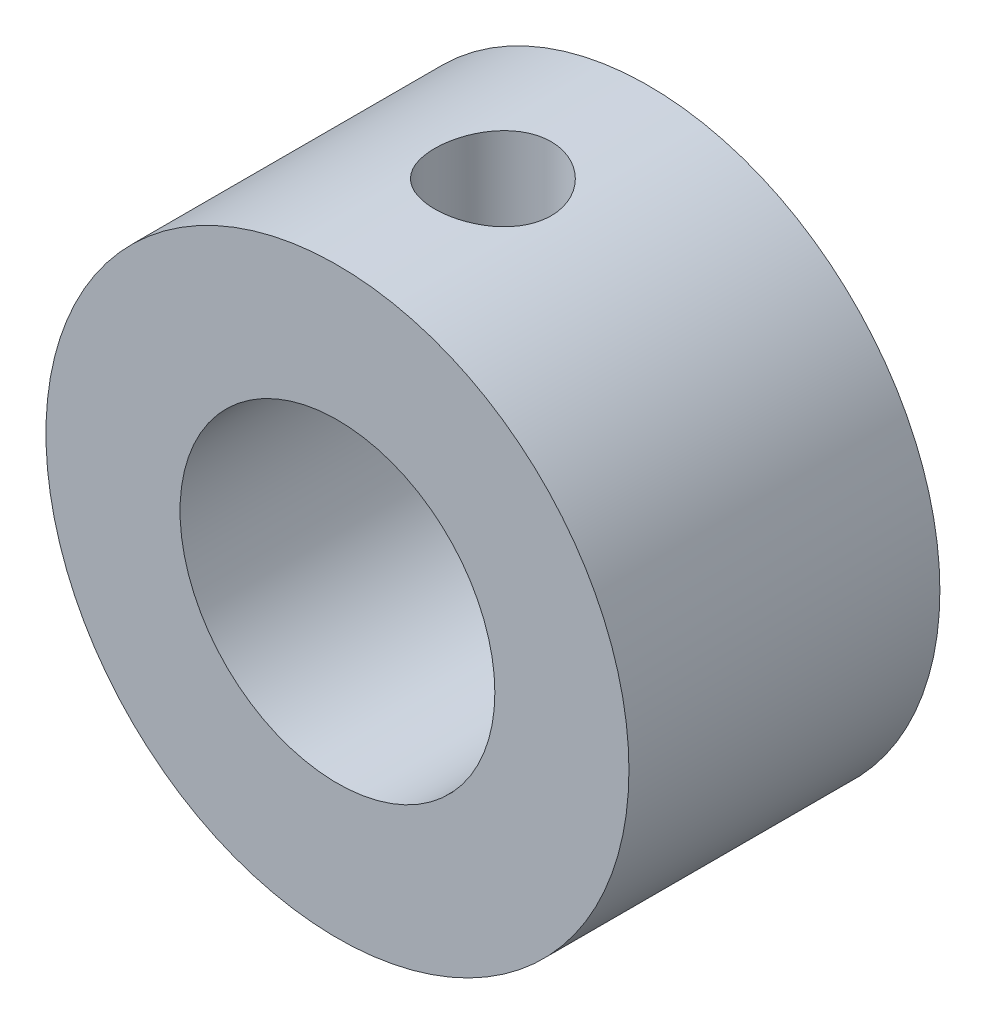
ISO-10303-21;
HEADER;
FILE_DESCRIPTION(('STEP AP214'),'2;1');
FILE_NAME('part.step','',(''),(''),'','','');
FILE_SCHEMA(('AUTOMOTIVE_DESIGN { 1 0 10303 214 1 1 1 1 }'));
ENDSEC;
DATA;
#1=APPLICATION_CONTEXT('core data for automotive mechanical design processes');
#2=APPLICATION_PROTOCOL_DEFINITION('international standard','automotive_design',2000,#1);
#3=PRODUCT_CONTEXT('',#1,'mechanical');
#4=PRODUCT('Part','Part','',(#3));
#5=PRODUCT_RELATED_PRODUCT_CATEGORY('part','',(#4));
#6=PRODUCT_DEFINITION_FORMATION('','',#4);
#7=PRODUCT_DEFINITION_CONTEXT('part definition',#1,'design');
#8=PRODUCT_DEFINITION('design','',#6,#7);
#9=PRODUCT_DEFINITION_SHAPE('','',#8);
#10=(LENGTH_UNIT() NAMED_UNIT(*) SI_UNIT(.MILLI.,.METRE.));
#11=(NAMED_UNIT(*) PLANE_ANGLE_UNIT() SI_UNIT($,.RADIAN.));
#12=(NAMED_UNIT(*) SI_UNIT($,.STERADIAN.) SOLID_ANGLE_UNIT());
#13=UNCERTAINTY_MEASURE_WITH_UNIT(LENGTH_MEASURE(1.E-05),#10,'distance_accuracy_value','');
#14=(GEOMETRIC_REPRESENTATION_CONTEXT(3) GLOBAL_UNCERTAINTY_ASSIGNED_CONTEXT((#13)) GLOBAL_UNIT_ASSIGNED_CONTEXT((#10,
#11,#12)) REPRESENTATION_CONTEXT('',''));
#15=CARTESIAN_POINT('',(0.,0.,0.));
#16=DIRECTION('',(0.,0.,1.));
#17=DIRECTION('',(1.,0.,0.));
#18=AXIS2_PLACEMENT_3D('',#15,#16,#17);
#19=CARTESIAN_POINT('',(0.,0.,8.));
#20=DIRECTION('',(0.,0.,1.));
#21=DIRECTION('',(1.,0.,0.));
#22=AXIS2_PLACEMENT_3D('',#19,#20,#21);
#23=PLANE('',#22);
#24=CARTESIAN_POINT('',(0.,0.,8.));
#25=DIRECTION('',(0.,0.,1.));
#26=DIRECTION('',(1.,0.,0.));
#27=AXIS2_PLACEMENT_3D('',#24,#25,#26);
#28=CIRCLE('',#27,7.5);
#29=CARTESIAN_POINT('',(7.5,0.,8.));
#30=VERTEX_POINT('',#29);
#31=EDGE_CURVE('E10',#30,#30,#28,.T.);
#32=ORIENTED_EDGE('',*,*,#31,.T.);
#33=EDGE_LOOP('',(#32));
#34=FACE_BOUND('',#33,.T.);
#35=CARTESIAN_POINT('',(0.,0.,8.));
#36=DIRECTION('',(0.,0.,1.));
#37=DIRECTION('',(1.,0.,0.));
#38=AXIS2_PLACEMENT_3D('',#35,#36,#37);
#39=CIRCLE('',#38,4.05);
#40=CARTESIAN_POINT('',(4.05,0.,8.));
#41=VERTEX_POINT('',#40);
#42=EDGE_CURVE('E54',#41,#41,#39,.T.);
#43=ORIENTED_EDGE('',*,*,#42,.F.);
#44=EDGE_LOOP('',(#43));
#45=FACE_BOUND('',#44,.T.);
#46=ADVANCED_FACE('F41',(#34,#45),#23,.T.);
#47=CARTESIAN_POINT('',(0.,0.,0.));
#48=DIRECTION('',(0.,0.,1.));
#49=DIRECTION('',(1.,0.,0.));
#50=AXIS2_PLACEMENT_3D('',#47,#48,#49);
#51=PLANE('',#50);
#52=CARTESIAN_POINT('',(0.,0.,0.));
#53=DIRECTION('',(0.,0.,1.));
#54=DIRECTION('',(1.,0.,0.));
#55=AXIS2_PLACEMENT_3D('',#52,#53,#54);
#56=CIRCLE('',#55,7.5);
#57=CARTESIAN_POINT('',(7.5,0.,0.));
#58=VERTEX_POINT('',#57);
#59=EDGE_CURVE('E45',#58,#58,#56,.T.);
#60=ORIENTED_EDGE('',*,*,#59,.F.);
#61=EDGE_LOOP('',(#60));
#62=FACE_BOUND('',#61,.T.);
#63=CARTESIAN_POINT('',(0.,0.,0.));
#64=DIRECTION('',(0.,0.,1.));
#65=DIRECTION('',(1.,0.,0.));
#66=AXIS2_PLACEMENT_3D('',#63,#64,#65);
#67=CIRCLE('',#66,4.05);
#68=CARTESIAN_POINT('',(4.05,0.,0.));
#69=VERTEX_POINT('',#68);
#70=EDGE_CURVE('E56',#69,#69,#67,.T.);
#71=ORIENTED_EDGE('',*,*,#70,.T.);
#72=EDGE_LOOP('',(#71));
#73=FACE_BOUND('',#72,.T.);
#74=ADVANCED_FACE('F90',(#62,#73),#51,.F.);
#75=CARTESIAN_POINT('',(0.,0.,8.));
#76=DIRECTION('',(0.,0.,-1.));
#77=DIRECTION('',(-1.,0.,0.));
#78=AXIS2_PLACEMENT_3D('',#75,#76,#77);
#79=CYLINDRICAL_SURFACE('',#78,7.5);
#80=CARTESIAN_POINT('',(0.,7.5,5.5));
#81=CARTESIAN_POINT('',(0.0833653601889499,7.49999846371307,5.49999693325248));
#82=CARTESIAN_POINT('',(0.166769490302284,7.49859577767346,5.49302673554853));
#83=CARTESIAN_POINT('',(0.331220261533529,7.49313548434847,5.46535224982713));
#84=CARTESIAN_POINT('',(0.412264976312034,7.48907576790279,5.44463705079774));
#85=CARTESIAN_POINT('',(0.569595457894969,7.4787547391743,5.39013808956882));
#86=CARTESIAN_POINT('',(0.645885701899701,7.47249553615077,5.35636684473297));
#87=CARTESIAN_POINT('',(0.791711983296338,7.45845597052971,5.27675162873306));
#88=CARTESIAN_POINT('',(0.861248422613718,7.4506756985356,5.23090837658919));
#89=CARTESIAN_POINT('',(0.992540215972297,7.43433247994955,5.12779225856285));
#90=CARTESIAN_POINT('',(1.05419092673779,7.42576118256521,5.0703874669132));
#91=CARTESIAN_POINT('',(1.16705513491204,7.40886270678882,4.94606137541245));
#92=CARTESIAN_POINT('',(1.21826781715564,7.40053554750636,4.87913933299732));
#93=CARTESIAN_POINT('',(1.30924763002143,7.38498662718923,4.73692571048219));
#94=CARTESIAN_POINT('',(1.3489064082988,7.37777561047419,4.66156353430546));
#95=CARTESIAN_POINT('',(1.41495849987046,7.36539402087627,4.50507727149388));
#96=CARTESIAN_POINT('',(1.44135312365586,7.36022324642942,4.42395375498048));
#97=CARTESIAN_POINT('',(1.47978794982724,7.35259207878307,4.25937345413813));
#98=CARTESIAN_POINT('',(1.49201174693817,7.35009705160781,4.17596118378666));
#99=CARTESIAN_POINT('',(1.50232819158918,7.34799562590941,4.00823526795349));
#100=CARTESIAN_POINT('',(1.50042228407025,7.34838893201761,3.92392171551978));
#101=CARTESIAN_POINT('',(1.48268185965273,7.35198826722277,3.7581298179685));
#102=CARTESIAN_POINT('',(1.46705781036586,7.35515179288145,3.67662789155903));
#103=CARTESIAN_POINT('',(1.42265682693458,7.36386819240002,3.5174258850055));
#104=CARTESIAN_POINT('',(1.39387926465102,7.36942118036668,3.43972598662149));
#105=CARTESIAN_POINT('',(1.32378717551208,7.38233427750612,3.2897271074446));
#106=CARTESIAN_POINT('',(1.28238922684817,7.38970634720557,3.21746818064624));
#107=CARTESIAN_POINT('',(1.18829036185902,7.40541928159593,3.08084372504078));
#108=CARTESIAN_POINT('',(1.13558814653524,7.41376025757549,3.01647910472326));
#109=CARTESIAN_POINT('',(1.01924990184088,7.43065531862193,2.8962558963146));
#110=CARTESIAN_POINT('',(0.955434241818667,7.43921053816357,2.8405711482113));
#111=CARTESIAN_POINT('',(0.819277536093015,7.45543273071613,2.74066923054816));
#112=CARTESIAN_POINT('',(0.746936381069083,7.4630996923346,2.69645220805963));
#113=CARTESIAN_POINT('',(0.595589080318381,7.47670035241331,2.62070873616104));
#114=CARTESIAN_POINT('',(0.51657272937795,7.48263133272408,2.58920215953319));
#115=CARTESIAN_POINT('',(0.354223464672998,7.49207113481787,2.53995928894215));
#116=CARTESIAN_POINT('',(0.270891075108675,7.49558025000797,2.52222132688956));
#117=CARTESIAN_POINT('',(0.103769108440726,7.49974007800301,2.50126531930858));
#118=CARTESIAN_POINT('',(0.0200104924883642,7.50043761978705,2.4978093706896));
#119=CARTESIAN_POINT('',(-0.146887401289071,7.49902577895154,2.50487478841327));
#120=CARTESIAN_POINT('',(-0.23002671366569,7.49691655412169,2.51539536902889));
#121=CARTESIAN_POINT('',(-0.392558489919812,7.49015748012026,2.54991756031593));
#122=CARTESIAN_POINT('',(-0.471977922509855,7.4855306460631,2.57379710274685));
#123=CARTESIAN_POINT('',(-0.625685441249501,7.47425328091549,2.63422597398371));
#124=CARTESIAN_POINT('',(-0.69997314245631,7.4676025982134,2.67077625201525));
#125=CARTESIAN_POINT('',(-0.842311760529326,7.45289867299942,2.75602373597697));
#126=CARTESIAN_POINT('',(-0.910275190128282,7.44482925655578,2.80486417155842));
#127=CARTESIAN_POINT('',(-1.03712702867881,7.42822102244824,2.91311378681092));
#128=CARTESIAN_POINT('',(-1.09601446339614,7.41968215452582,2.9725240995998));
#129=CARTESIAN_POINT('',(-1.20396088616126,7.40293955335447,3.10131002783669));
#130=CARTESIAN_POINT('',(-1.25285655367298,7.39474290349956,3.17082361633201));
#131=CARTESIAN_POINT('',(-1.33827813007681,7.37976287694291,3.31721704203502));
#132=CARTESIAN_POINT('',(-1.37480453388435,7.37297944370014,3.39409658436033));
#133=CARTESIAN_POINT('',(-1.43422776237294,7.36165110876574,3.55265236922432));
#134=CARTESIAN_POINT('',(-1.45719524968658,7.3570946230828,3.63430126181548));
#135=CARTESIAN_POINT('',(-1.48906297744079,7.35071155188038,3.80040018023636));
#136=CARTESIAN_POINT('',(-1.49796505233767,7.34888461036667,3.88484983931402));
#137=CARTESIAN_POINT('',(-1.5013813663012,7.34818724447069,4.05251329681648));
#138=CARTESIAN_POINT('',(-1.49615368210634,7.34926378783951,4.13572172339051));
#139=CARTESIAN_POINT('',(-1.47202845615009,7.35413360226921,4.30004747485754));
#140=CARTESIAN_POINT('',(-1.45313102419395,7.35792685150754,4.38116481654221));
#141=CARTESIAN_POINT('',(-1.40231785274843,7.36777896328738,4.53884156686082));
#142=CARTESIAN_POINT('',(-1.37043376007602,7.37383231528246,4.61541154075362));
#143=CARTESIAN_POINT('',(-1.29458196690241,7.38752572461255,4.76215558110166));
#144=CARTESIAN_POINT('',(-1.25061325316232,7.39516591498341,4.83232911058771));
#145=CARTESIAN_POINT('',(-1.15095887217962,7.41133440784838,4.96557335822547));
#146=CARTESIAN_POINT('',(-1.09508683085277,7.41987559364549,5.02850314790139));
#147=CARTESIAN_POINT('',(-0.97359655351971,7.43679122807932,5.14417930829376));
#148=CARTESIAN_POINT('',(-0.907976080730002,7.44516563794777,5.19692333547591));
#149=CARTESIAN_POINT('',(-0.76802644363237,7.46090748581957,5.29125196591967));
#150=CARTESIAN_POINT('',(-0.693613326644752,7.46826346828869,5.33271400492004));
#151=CARTESIAN_POINT('',(-0.538749541411099,7.481026876275,5.40247918389489));
#152=CARTESIAN_POINT('',(-0.458304391294689,7.48643605707924,5.43079418429874));
#153=CARTESIAN_POINT('',(-0.314732233385669,7.49364558893056,5.46797792206707));
#154=CARTESIAN_POINT('',(-0.252422496020677,7.49601454737677,5.47996479056164));
#155=CARTESIAN_POINT('',(-0.1267492878151,7.49919231209839,5.49597686853755));
#156=CARTESIAN_POINT('',(-0.0633858506229286,7.50000116809732,5.50000233176465));
#157=CARTESIAN_POINT('',(0.,7.5,5.5));
#158=B_SPLINE_CURVE_WITH_KNOTS('',3,(#80,#81,#82,#83,#84,#85,#86,#87,#88,#89,#90,#91,#92,#93,
#94,#95,#96,#97,#98,#99,#100,#101,#102,#103,#104,#105,#106,#107,#108,#109,#110,#111,#112,#113,
#114,#115,#116,#117,#118,#119,#120,#121,#122,#123,#124,#125,#126,#127,#128,#129,#130,#131,#132,
#133,#134,#135,#136,#137,#138,#139,#140,#141,#142,#143,#144,#145,#146,#147,#148,#149,#150,#151,
#152,#153,#154,#155,#156,#157),.UNSPECIFIED.,.T.,.F.,(4,2,2,2,2,2,2,2,2,2,2,2,2,2,2,2,2,2,2,2,2,
2,2,2,2,2,2,2,2,2,2,2,2,2,2,2,2,2,4),(0.,0.249864195991888,0.499926976036985,0.749750602875512,
0.999559353346295,1.25239900516828,1.50525839512105,1.76041792508884,2.01555224047796,
2.26734277655381,2.51910756421838,2.76707590509417,3.01505608880595,3.26471235305389,
3.51439732124506,3.76857378737026,4.0227535130973,4.27732912281036,4.53187388547054,
4.78216103514398,5.03243411486801,5.28045680926085,5.52849808824033,5.77957599050038,
6.03068082518895,6.28560942868839,6.540527830852,6.79410571549085,7.04765052495622,
7.29659583851552,7.54553915238913,7.79387941879665,8.042240513728,8.29482114358714,
8.54745981799396,8.80274245013455,9.05779433276278,9.24778162934841,9.43776287056494),.UNSPECIFIED.);
#159=CARTESIAN_POINT('',(0.,7.5,5.5));
#160=VERTEX_POINT('',#159);
#161=EDGE_CURVE('E72',#160,#160,#158,.T.);
#162=ORIENTED_EDGE('',*,*,#161,.F.);
#163=EDGE_LOOP('',(#162));
#164=FACE_BOUND('',#163,.T.);
#165=ORIENTED_EDGE('',*,*,#31,.F.);
#166=EDGE_LOOP('',(#165));
#167=FACE_BOUND('',#166,.T.);
#168=ORIENTED_EDGE('',*,*,#59,.T.);
#169=EDGE_LOOP('',(#168));
#170=FACE_BOUND('',#169,.T.);
#171=ADVANCED_FACE('F43',(#164,#167,#170),#79,.T.);
#172=CARTESIAN_POINT('',(0.,0.,8.));
#173=DIRECTION('',(0.,0.,-1.));
#174=DIRECTION('',(-1.,0.,0.));
#175=AXIS2_PLACEMENT_3D('',#172,#173,#174);
#176=CYLINDRICAL_SURFACE('',#175,4.05);
#177=CARTESIAN_POINT('',(0.,4.05,5.5));
#178=CARTESIAN_POINT('',(0.0813057928252726,4.05000190684964,5.50000256889453));
#179=CARTESIAN_POINT('',(0.162593778842905,4.04753015942369,5.49336859181153));
#180=CARTESIAN_POINT('',(0.322744321247835,4.03791645342917,5.46711226930628));
#181=CARTESIAN_POINT('',(0.401607159693026,4.03077504013559,5.44749144035019));
#182=CARTESIAN_POINT('',(0.554574882390271,4.01258967206723,5.39604788781078));
#183=CARTESIAN_POINT('',(0.628688495180003,4.0015531342112,5.36424834464819));
#184=CARTESIAN_POINT('',(0.770524841097714,3.9766798809375,5.28946641803674));
#185=CARTESIAN_POINT('',(0.83824589928376,3.96284243461099,5.24648111477884));
#186=CARTESIAN_POINT('',(0.96819083553232,3.93315608338425,5.14867969317039));
#187=CARTESIAN_POINT('',(1.03011349848364,3.9172512226039,5.09348049909808));
#188=CARTESIAN_POINT('',(1.14406405365866,3.88550162341928,4.97363148949509));
#189=CARTESIAN_POINT('',(1.19608902421425,3.86965690411648,4.90897889337445));
#190=CARTESIAN_POINT('',(1.29065950678702,3.83917474740892,4.76914234195351));
#191=CARTESIAN_POINT('',(1.33278350019468,3.82460359167331,4.69365742710139));
#192=CARTESIAN_POINT('',(1.40360481224117,3.79918673885421,4.53604945226634));
#193=CARTESIAN_POINT('',(1.43230734401711,3.7883395957331,4.45392898421178));
#194=CARTESIAN_POINT('',(1.47428861755546,3.77219612106727,4.28884435594164));
#195=CARTESIAN_POINT('',(1.48814111936763,3.76669413774263,4.20604688350595));
#196=CARTESIAN_POINT('',(1.50182316056304,3.76126133505072,4.03913388579892));
#197=CARTESIAN_POINT('',(1.50165831030855,3.7613282867499,3.95501890133161));
#198=CARTESIAN_POINT('',(1.48774983468063,3.76684813019103,3.79306461817652));
#199=CARTESIAN_POINT('',(1.47479635876387,3.77198760857952,3.71514481311704));
#200=CARTESIAN_POINT('',(1.43698257056314,3.78655348622985,3.56267552266416));
#201=CARTESIAN_POINT('',(1.41212050986431,3.79598051497831,3.48812653393251));
#202=CARTESIAN_POINT('',(1.35075201746899,3.8182519164829,3.34288347209925));
#203=CARTESIAN_POINT('',(1.31403734476428,3.83115666398053,3.27228705034921));
#204=CARTESIAN_POINT('',(1.23015087973739,3.85890876329535,3.13802547051404));
#205=CARTESIAN_POINT('',(1.18297554018298,3.87375677337506,3.07436267458077));
#206=CARTESIAN_POINT('',(1.07587119601217,3.90490783560719,2.95139370972854));
#207=CARTESIAN_POINT('',(1.01530968027133,3.92124252553707,2.89264514162342));
#208=CARTESIAN_POINT('',(0.885004320862722,3.95268957320884,2.7859745152926));
#209=CARTESIAN_POINT('',(0.81525913673422,3.96780175199051,2.73805404032878));
#210=CARTESIAN_POINT('',(0.667172091708017,3.99538847714597,2.65380503359598));
#211=CARTESIAN_POINT('',(0.588718582768837,4.00782082069767,2.61765795044718));
#212=CARTESIAN_POINT('',(0.426269464236324,4.02833493180856,2.55925875797701));
#213=CARTESIAN_POINT('',(0.342276270688066,4.03641858207884,2.53700063493958));
#214=CARTESIAN_POINT('',(0.175828141228284,4.04699575761889,2.50807330466523));
#215=CARTESIAN_POINT('',(0.0935207212496039,4.04975836688583,2.50065294515477));
#216=CARTESIAN_POINT('',(-0.0711998207676849,4.05021087870637,2.49943009285028));
#217=CARTESIAN_POINT('',(-0.153612916233075,4.04790187329574,2.50562466844651));
#218=CARTESIAN_POINT('',(-0.312987428278235,4.0386482328676,2.53088192541724));
#219=CARTESIAN_POINT('',(-0.390037539529892,4.03187966703049,2.54945615300114));
#220=CARTESIAN_POINT('',(-0.53987639864684,4.01456427234243,2.59830611702506));
#221=CARTESIAN_POINT('',(-0.612664590596399,4.00401695187038,2.62858337608581));
#222=CARTESIAN_POINT('',(-0.754285680034565,3.97980740985222,2.70093871848519));
#223=CARTESIAN_POINT('',(-0.822941827063077,3.9660634721022,2.74333458341842));
#224=CARTESIAN_POINT('',(-0.952392873580007,3.93698573096534,2.83836297394195));
#225=CARTESIAN_POINT('',(-1.01318490885942,3.92165135196287,2.89099921182663));
#226=CARTESIAN_POINT('',(-1.12877707743091,3.89000724571093,3.00852008029745));
#227=CARTESIAN_POINT('',(-1.18304374049599,3.8736914134158,3.07392914011313));
#228=CARTESIAN_POINT('',(-1.27993140553066,3.84276848938387,3.21325054532476));
#229=CARTESIAN_POINT('',(-1.32255149653358,3.82816153136216,3.28716355523692));
#230=CARTESIAN_POINT('',(-1.39494494410103,3.80238321758357,3.44192608338742));
#231=CARTESIAN_POINT('',(-1.42467567389744,3.79122329607762,3.52279757340141));
#232=CARTESIAN_POINT('',(-1.46990891668359,3.77391913708067,3.6889257877125));
#233=CARTESIAN_POINT('',(-1.48541993882698,3.7677719002145,3.77417985714726));
#234=CARTESIAN_POINT('',(-1.50102328243792,3.76158115853795,3.94088872746385));
#235=CARTESIAN_POINT('',(-1.50202240812051,3.76117870862021,4.02224605663162));
#236=CARTESIAN_POINT('',(-1.49088624743653,3.76560664633813,4.18390383975131));
#237=CARTESIAN_POINT('',(-1.47875214429038,3.7704365625709,4.26420438825278));
#238=CARTESIAN_POINT('',(-1.44239322514254,3.7844896820656,4.41910734307399));
#239=CARTESIAN_POINT('',(-1.41852966445647,3.7935812646814,4.49380749681997));
#240=CARTESIAN_POINT('',(-1.3597041130553,3.81505968346907,4.6381894463558));
#241=CARTESIAN_POINT('',(-1.32473935007264,3.82744734263428,4.70786998327434));
#242=CARTESIAN_POINT('',(-1.2426137509176,3.85491571809485,4.84413324331247));
#243=CARTESIAN_POINT('',(-1.19491773712856,3.8701022411799,4.91037183976469));
#244=CARTESIAN_POINT('',(-1.089520632804,3.90108436911771,5.03419529366597));
#245=CARTESIAN_POINT('',(-1.03181640252525,3.91688016389621,5.09177742482421));
#246=CARTESIAN_POINT('',(-0.904434315138626,3.94829265287565,5.19971789580477));
#247=CARTESIAN_POINT('',(-0.834288311277961,3.9638568468105,5.24954145400537));
#248=CARTESIAN_POINT('',(-0.686074814332645,3.99217834453093,5.33667121440369));
#249=CARTESIAN_POINT('',(-0.608007033135184,4.0049355461735,5.37397696111945));
#250=CARTESIAN_POINT('',(-0.44340028567782,4.02653686412394,5.43574729159752));
#251=CARTESIAN_POINT('',(-0.356666914934943,4.03523814039571,5.45974808440099));
#252=CARTESIAN_POINT('',(-0.179947396111378,4.04696731962802,5.49186928400106));
#253=CARTESIAN_POINT('',(-0.0899627977419169,4.04999789011923,5.49999715758336));
#254=CARTESIAN_POINT('',(0.,4.05,5.5));
#255=B_SPLINE_CURVE_WITH_KNOTS('',3,(#177,#178,#179,#180,#181,#182,#183,#184,#185,#186,#187,
#188,#189,#190,#191,#192,#193,#194,#195,#196,#197,#198,#199,#200,#201,#202,#203,#204,#205,#206,
#207,#208,#209,#210,#211,#212,#213,#214,#215,#216,#217,#218,#219,#220,#221,#222,#223,#224,#225,
#226,#227,#228,#229,#230,#231,#232,#233,#234,#235,#236,#237,#238,#239,#240,#241,#242,#243,#244,
#245,#246,#247,#248,#249,#250,#251,#252,#253,#254),.UNSPECIFIED.,.T.,.F.,(4,2,2,2,2,2,2,2,2,2,2,
2,2,2,2,2,2,2,2,2,2,2,2,2,2,2,2,2,2,2,2,2,2,2,2,2,2,2,4),(0.,0.243585635592386,
0.487142832866919,0.730238739798339,0.973398165602104,1.22567234768105,1.47802088261543,
1.7396979151946,2.00127322310642,2.25233104714478,2.50328838724688,2.73965281169046,
2.97605194973048,3.21685377941645,3.45773739068142,3.71438203322365,3.97106417757825,
4.23153320773398,4.49188938021996,4.73869301405964,4.98544351058737,5.22299289775759,
5.46057320165501,5.70506748748254,5.94965057200196,6.20806903353643,6.46650770215539,
6.72579465906651,6.98492635572058,7.22779068357943,7.47063313272786,7.70642518201837,
7.9422761612751,8.1902683935837,8.43833856635144,8.69937294798869,8.9604168267779,
9.23006503080961,9.49958635894827),.UNSPECIFIED.);
#256=CARTESIAN_POINT('',(0.,4.05,5.5));
#257=VERTEX_POINT('',#256);
#258=EDGE_CURVE('E60',#257,#257,#255,.T.);
#259=ORIENTED_EDGE('',*,*,#258,.T.);
#260=EDGE_LOOP('',(#259));
#261=FACE_BOUND('',#260,.T.);
#262=ORIENTED_EDGE('',*,*,#42,.T.);
#263=EDGE_LOOP('',(#262));
#264=FACE_BOUND('',#263,.T.);
#265=ORIENTED_EDGE('',*,*,#70,.F.);
#266=EDGE_LOOP('',(#265));
#267=FACE_BOUND('',#266,.T.);
#268=ADVANCED_FACE('F83',(#261,#264,#267),#176,.F.);
#269=CARTESIAN_POINT('',(0.,-7.501,4.));
#270=DIRECTION('',(0.,1.,0.));
#271=DIRECTION('',(0.,0.,1.));
#272=AXIS2_PLACEMENT_3D('',#269,#270,#271);
#273=CYLINDRICAL_SURFACE('',#272,1.5);
#274=ORIENTED_EDGE('',*,*,#258,.F.);
#275=EDGE_LOOP('',(#274));
#276=FACE_BOUND('',#275,.T.);
#277=ORIENTED_EDGE('',*,*,#161,.T.);
#278=EDGE_LOOP('',(#277));
#279=FACE_BOUND('',#278,.T.);
#280=ADVANCED_FACE('F77',(#276,#279),#273,.F.);
#281=CLOSED_SHELL('',(#46,#74,#171,#268,#280));
#282=MANIFOLD_SOLID_BREP('B2',#281);
#283=ADVANCED_BREP_SHAPE_REPRESENTATION('',(#18,#282),#14);
#284=SHAPE_DEFINITION_REPRESENTATION(#9,#283);
ENDSEC;
END-ISO-10303-21;
